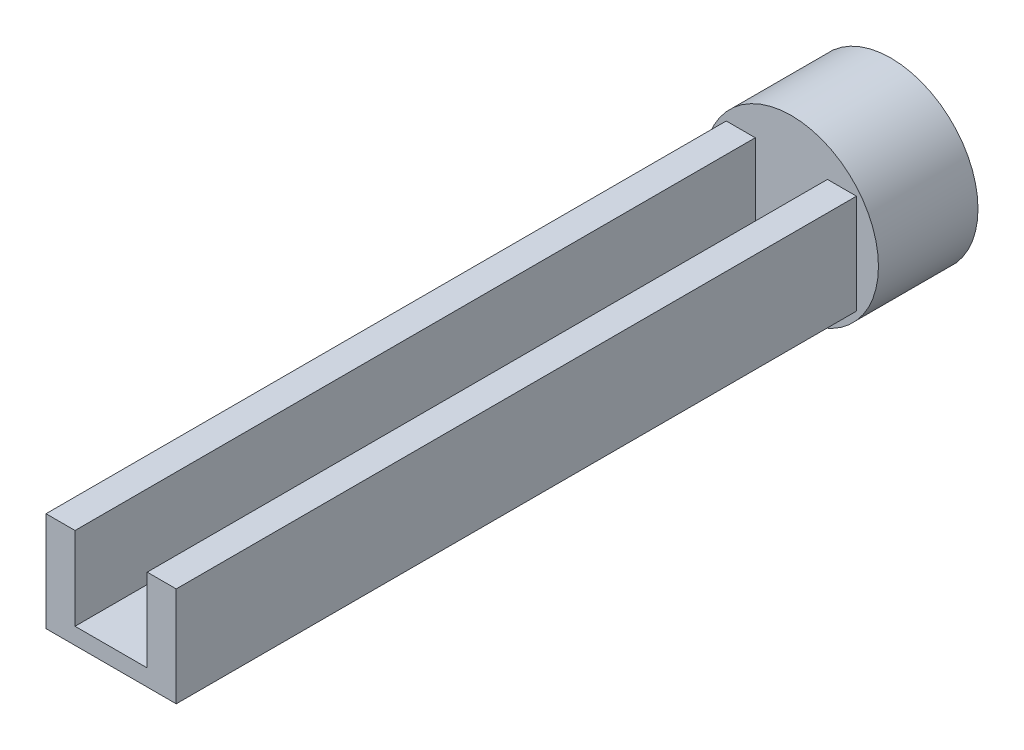
ISO-10303-21;
HEADER;
FILE_DESCRIPTION(('STEP AP214'),'2;1');
FILE_NAME('part.step','',(''),(''),'','','');
FILE_SCHEMA(('AUTOMOTIVE_DESIGN { 1 0 10303 214 1 1 1 1 }'));
ENDSEC;
DATA;
#1=APPLICATION_CONTEXT('core data for automotive mechanical design processes');
#2=APPLICATION_PROTOCOL_DEFINITION('international standard','automotive_design',2000,#1);
#3=PRODUCT_CONTEXT('',#1,'mechanical');
#4=PRODUCT('Part','Part','',(#3));
#5=PRODUCT_RELATED_PRODUCT_CATEGORY('part','',(#4));
#6=PRODUCT_DEFINITION_FORMATION('','',#4);
#7=PRODUCT_DEFINITION_CONTEXT('part definition',#1,'design');
#8=PRODUCT_DEFINITION('design','',#6,#7);
#9=PRODUCT_DEFINITION_SHAPE('','',#8);
#10=(LENGTH_UNIT() NAMED_UNIT(*) SI_UNIT(.MILLI.,.METRE.));
#11=(NAMED_UNIT(*) PLANE_ANGLE_UNIT() SI_UNIT($,.RADIAN.));
#12=(NAMED_UNIT(*) SI_UNIT($,.STERADIAN.) SOLID_ANGLE_UNIT());
#13=UNCERTAINTY_MEASURE_WITH_UNIT(LENGTH_MEASURE(1.E-05),#10,'distance_accuracy_value','');
#14=(GEOMETRIC_REPRESENTATION_CONTEXT(3) GLOBAL_UNCERTAINTY_ASSIGNED_CONTEXT((#13)) GLOBAL_UNIT_ASSIGNED_CONTEXT((#10,
#11,#12)) REPRESENTATION_CONTEXT('',''));
#15=CARTESIAN_POINT('',(0.,0.,0.));
#16=DIRECTION('',(0.,0.,1.));
#17=DIRECTION('',(1.,0.,0.));
#18=AXIS2_PLACEMENT_3D('',#15,#16,#17);
#19=CARTESIAN_POINT('',(0.,12.,0.));
#20=DIRECTION('',(0.,1.,0.));
#21=DIRECTION('',(0.,0.,1.));
#22=AXIS2_PLACEMENT_3D('',#19,#20,#21);
#23=PLANE('',#22);
#24=DIRECTION('',(0.,0.,-1.));
#25=VECTOR('',#24,1.);
#26=CARTESIAN_POINT('',(4.35,12.,41.));
#27=LINE('',#26,#25);
#28=CARTESIAN_POINT('',(4.35,12.,41.));
#29=VERTEX_POINT('',#28);
#30=CARTESIAN_POINT('',(4.35,12.,-41.));
#31=VERTEX_POINT('',#30);
#32=EDGE_CURVE('E135',#29,#31,#27,.T.);
#33=ORIENTED_EDGE('',*,*,#32,.F.);
#34=DIRECTION('',(1.,0.,0.));
#35=VECTOR('',#34,1.);
#36=CARTESIAN_POINT('',(7.85,12.,41.));
#37=LINE('',#36,#35);
#38=CARTESIAN_POINT('',(7.85,12.,41.));
#39=VERTEX_POINT('',#38);
#40=EDGE_CURVE('E58',#29,#39,#37,.T.);
#41=ORIENTED_EDGE('',*,*,#40,.T.);
#42=DIRECTION('',(0.,0.,-1.));
#43=VECTOR('',#42,1.);
#44=CARTESIAN_POINT('',(7.85,12.,41.));
#45=LINE('',#44,#43);
#46=CARTESIAN_POINT('',(7.85,12.,-41.));
#47=VERTEX_POINT('',#46);
#48=EDGE_CURVE('E88',#39,#47,#45,.T.);
#49=ORIENTED_EDGE('',*,*,#48,.T.);
#50=DIRECTION('',(-1.,0.,0.));
#51=VECTOR('',#50,1.);
#52=CARTESIAN_POINT('',(7.85,12.,-41.));
#53=LINE('',#52,#51);
#54=EDGE_CURVE('E101',#47,#31,#53,.T.);
#55=ORIENTED_EDGE('',*,*,#54,.T.);
#56=EDGE_LOOP('',(#33,#41,#49,#55));
#57=FACE_BOUND('',#56,.T.);
#58=ADVANCED_FACE('F34',(#57),#23,.T.);
#59=CARTESIAN_POINT('',(-7.85,12.,41.));
#60=DIRECTION('',(1.,0.,0.));
#61=DIRECTION('',(0.,0.,-1.));
#62=AXIS2_PLACEMENT_3D('',#59,#60,#61);
#63=PLANE('',#62);
#64=DIRECTION('',(0.,0.,1.));
#65=VECTOR('',#64,1.);
#66=CARTESIAN_POINT('',(-7.85,0.,41.));
#67=LINE('',#66,#65);
#68=CARTESIAN_POINT('',(-7.85,0.,-41.));
#69=VERTEX_POINT('',#68);
#70=CARTESIAN_POINT('',(-7.85,0.,41.));
#71=VERTEX_POINT('',#70);
#72=EDGE_CURVE('E80',#69,#71,#67,.T.);
#73=ORIENTED_EDGE('',*,*,#72,.T.);
#74=DIRECTION('',(0.,-1.,0.));
#75=VECTOR('',#74,1.);
#76=CARTESIAN_POINT('',(-7.85,12.,41.));
#77=LINE('',#76,#75);
#78=CARTESIAN_POINT('',(-7.85,12.,41.));
#79=VERTEX_POINT('',#78);
#80=EDGE_CURVE('E11',#79,#71,#77,.T.);
#81=ORIENTED_EDGE('',*,*,#80,.F.);
#82=DIRECTION('',(0.,0.,1.));
#83=VECTOR('',#82,1.);
#84=CARTESIAN_POINT('',(-7.85,12.,41.));
#85=LINE('',#84,#83);
#86=CARTESIAN_POINT('',(-7.85,12.,-41.));
#87=VERTEX_POINT('',#86);
#88=EDGE_CURVE('E94',#87,#79,#85,.T.);
#89=ORIENTED_EDGE('',*,*,#88,.F.);
#90=DIRECTION('',(0.,-1.,0.));
#91=VECTOR('',#90,1.);
#92=CARTESIAN_POINT('',(-7.85,12.,-41.));
#93=LINE('',#92,#91);
#94=EDGE_CURVE('E98',#87,#69,#93,.T.);
#95=ORIENTED_EDGE('',*,*,#94,.T.);
#96=EDGE_LOOP('',(#73,#81,#89,#95));
#97=FACE_BOUND('',#96,.T.);
#98=ADVANCED_FACE('F36',(#97),#63,.F.);
#99=CARTESIAN_POINT('',(7.85,12.,41.));
#100=DIRECTION('',(0.,0.,-1.));
#101=DIRECTION('',(-1.,0.,0.));
#102=AXIS2_PLACEMENT_3D('',#99,#100,#101);
#103=PLANE('',#102);
#104=ORIENTED_EDGE('',*,*,#40,.F.);
#105=DIRECTION('',(0.,1.,0.));
#106=VECTOR('',#105,1.);
#107=CARTESIAN_POINT('',(4.35,2.,41.));
#108=LINE('',#107,#106);
#109=CARTESIAN_POINT('',(4.35,2.,41.));
#110=VERTEX_POINT('',#109);
#111=EDGE_CURVE('E132',#110,#29,#108,.T.);
#112=ORIENTED_EDGE('',*,*,#111,.F.);
#113=DIRECTION('',(1.,0.,0.));
#114=VECTOR('',#113,1.);
#115=CARTESIAN_POINT('',(-4.34999999999999,2.,41.));
#116=LINE('',#115,#114);
#117=CARTESIAN_POINT('',(-4.34999999999999,2.,41.));
#118=VERTEX_POINT('',#117);
#119=EDGE_CURVE('E162',#118,#110,#116,.T.);
#120=ORIENTED_EDGE('',*,*,#119,.F.);
#121=DIRECTION('',(0.,1.,0.));
#122=VECTOR('',#121,1.);
#123=CARTESIAN_POINT('',(-4.34999999999999,2.,41.));
#124=LINE('',#123,#122);
#125=CARTESIAN_POINT('',(-4.34999999999999,12.,41.));
#126=VERTEX_POINT('',#125);
#127=EDGE_CURVE('E140',#118,#126,#124,.T.);
#128=ORIENTED_EDGE('',*,*,#127,.T.);
#129=EDGE_CURVE('E145',#79,#126,#37,.T.);
#130=ORIENTED_EDGE('',*,*,#129,.F.);
#131=ORIENTED_EDGE('',*,*,#80,.T.);
#132=DIRECTION('',(1.,0.,0.));
#133=VECTOR('',#132,1.);
#134=CARTESIAN_POINT('',(7.85,0.,41.));
#135=LINE('',#134,#133);
#136=CARTESIAN_POINT('',(7.85,0.,41.));
#137=VERTEX_POINT('',#136);
#138=EDGE_CURVE('E70',#71,#137,#135,.T.);
#139=ORIENTED_EDGE('',*,*,#138,.T.);
#140=DIRECTION('',(0.,-1.,0.));
#141=VECTOR('',#140,1.);
#142=CARTESIAN_POINT('',(7.85,12.,41.));
#143=LINE('',#142,#141);
#144=EDGE_CURVE('E42',#39,#137,#143,.T.);
#145=ORIENTED_EDGE('',*,*,#144,.F.);
#146=EDGE_LOOP('',(#104,#112,#120,#128,#130,#131,#139,#145));
#147=FACE_BOUND('',#146,.T.);
#148=ADVANCED_FACE('F72',(#147),#103,.F.);
#149=CARTESIAN_POINT('',(7.85,12.,41.));
#150=DIRECTION('',(-1.,0.,0.));
#151=DIRECTION('',(0.,0.,1.));
#152=AXIS2_PLACEMENT_3D('',#149,#150,#151);
#153=PLANE('',#152);
#154=DIRECTION('',(0.,0.,-1.));
#155=VECTOR('',#154,1.);
#156=CARTESIAN_POINT('',(7.85,0.,41.));
#157=LINE('',#156,#155);
#158=CARTESIAN_POINT('',(7.85,0.,-41.));
#159=VERTEX_POINT('',#158);
#160=EDGE_CURVE('E79',#137,#159,#157,.T.);
#161=ORIENTED_EDGE('',*,*,#160,.T.);
#162=DIRECTION('',(0.,-1.,0.));
#163=VECTOR('',#162,1.);
#164=CARTESIAN_POINT('',(7.85,12.,-41.));
#165=LINE('',#164,#163);
#166=EDGE_CURVE('E89',#47,#159,#165,.T.);
#167=ORIENTED_EDGE('',*,*,#166,.F.);
#168=ORIENTED_EDGE('',*,*,#48,.F.);
#169=ORIENTED_EDGE('',*,*,#144,.T.);
#170=EDGE_LOOP('',(#161,#167,#168,#169));
#171=FACE_BOUND('',#170,.T.);
#172=ADVANCED_FACE('F84',(#171),#153,.F.);
#173=DIRECTION('',(0.,0.,1.));
#174=VECTOR('',#173,1.);
#175=CARTESIAN_POINT('',(-4.35,12.,-41.));
#176=LINE('',#175,#174);
#177=CARTESIAN_POINT('',(-4.35,12.,-41.));
#178=VERTEX_POINT('',#177);
#179=EDGE_CURVE('E143',#178,#126,#176,.T.);
#180=ORIENTED_EDGE('',*,*,#179,.F.);
#181=EDGE_CURVE('E49',#178,#87,#53,.T.);
#182=ORIENTED_EDGE('',*,*,#181,.T.);
#183=ORIENTED_EDGE('',*,*,#88,.T.);
#184=ORIENTED_EDGE('',*,*,#129,.T.);
#185=EDGE_LOOP('',(#180,#182,#183,#184));
#186=FACE_BOUND('',#185,.T.);
#187=ADVANCED_FACE('F182',(#186),#23,.T.);
#188=CARTESIAN_POINT('',(0.,0.,0.));
#189=DIRECTION('',(0.,1.,0.));
#190=DIRECTION('',(0.,0.,1.));
#191=AXIS2_PLACEMENT_3D('',#188,#189,#190);
#192=PLANE('',#191);
#193=ORIENTED_EDGE('',*,*,#72,.F.);
#194=DIRECTION('',(-1.,0.,0.));
#195=VECTOR('',#194,1.);
#196=CARTESIAN_POINT('',(7.85,0.,-41.));
#197=LINE('',#196,#195);
#198=EDGE_CURVE('E92',#159,#69,#197,.T.);
#199=ORIENTED_EDGE('',*,*,#198,.F.);
#200=ORIENTED_EDGE('',*,*,#160,.F.);
#201=ORIENTED_EDGE('',*,*,#138,.F.);
#202=EDGE_LOOP('',(#193,#199,#200,#201));
#203=FACE_BOUND('',#202,.T.);
#204=ADVANCED_FACE('F90',(#203),#192,.F.);
#205=CARTESIAN_POINT('',(4.35,2.,41.));
#206=DIRECTION('',(1.,0.,0.));
#207=DIRECTION('',(0.,0.,-1.));
#208=AXIS2_PLACEMENT_3D('',#205,#206,#207);
#209=PLANE('',#208);
#210=ORIENTED_EDGE('',*,*,#32,.T.);
#211=DIRECTION('',(0.,1.,0.));
#212=VECTOR('',#211,1.);
#213=CARTESIAN_POINT('',(4.35,2.,-41.));
#214=LINE('',#213,#212);
#215=CARTESIAN_POINT('',(4.35,2.,-41.));
#216=VERTEX_POINT('',#215);
#217=EDGE_CURVE('E139',#216,#31,#214,.T.);
#218=ORIENTED_EDGE('',*,*,#217,.F.);
#219=DIRECTION('',(0.,0.,-1.));
#220=VECTOR('',#219,1.);
#221=CARTESIAN_POINT('',(4.35,2.,41.));
#222=LINE('',#221,#220);
#223=EDGE_CURVE('E137',#110,#216,#222,.T.);
#224=ORIENTED_EDGE('',*,*,#223,.F.);
#225=ORIENTED_EDGE('',*,*,#111,.T.);
#226=EDGE_LOOP('',(#210,#218,#224,#225));
#227=FACE_BOUND('',#226,.T.);
#228=ADVANCED_FACE('F133',(#227),#209,.F.);
#229=CARTESIAN_POINT('',(-4.35,2.,-41.));
#230=DIRECTION('',(-1.,0.,0.));
#231=DIRECTION('',(0.,0.,1.));
#232=AXIS2_PLACEMENT_3D('',#229,#230,#231);
#233=PLANE('',#232);
#234=ORIENTED_EDGE('',*,*,#179,.T.);
#235=ORIENTED_EDGE('',*,*,#127,.F.);
#236=DIRECTION('',(0.,0.,1.));
#237=VECTOR('',#236,1.);
#238=CARTESIAN_POINT('',(-4.35,2.,-41.));
#239=LINE('',#238,#237);
#240=CARTESIAN_POINT('',(-4.35,2.,-41.));
#241=VERTEX_POINT('',#240);
#242=EDGE_CURVE('E166',#241,#118,#239,.T.);
#243=ORIENTED_EDGE('',*,*,#242,.F.);
#244=DIRECTION('',(0.,1.,0.));
#245=VECTOR('',#244,1.);
#246=CARTESIAN_POINT('',(-4.35,2.,-41.));
#247=LINE('',#246,#245);
#248=EDGE_CURVE('E158',#241,#178,#247,.T.);
#249=ORIENTED_EDGE('',*,*,#248,.T.);
#250=EDGE_LOOP('',(#234,#235,#243,#249));
#251=FACE_BOUND('',#250,.T.);
#252=ADVANCED_FACE('F230',(#251),#233,.F.);
#253=CARTESIAN_POINT('',(0.,2.,0.));
#254=DIRECTION('',(0.,1.,0.));
#255=DIRECTION('',(0.,0.,1.));
#256=AXIS2_PLACEMENT_3D('',#253,#254,#255);
#257=PLANE('',#256);
#258=DIRECTION('',(-1.,0.,0.));
#259=VECTOR('',#258,1.);
#260=CARTESIAN_POINT('',(4.35,2.,-41.));
#261=LINE('',#260,#259);
#262=EDGE_CURVE('E142',#216,#241,#261,.T.);
#263=ORIENTED_EDGE('',*,*,#262,.T.);
#264=ORIENTED_EDGE('',*,*,#242,.T.);
#265=ORIENTED_EDGE('',*,*,#119,.T.);
#266=ORIENTED_EDGE('',*,*,#223,.T.);
#267=EDGE_LOOP('',(#263,#264,#265,#266));
#268=FACE_BOUND('',#267,.T.);
#269=ADVANCED_FACE('F179',(#268),#257,.T.);
#270=CARTESIAN_POINT('',(0.,5.99999999999999,-53.));
#271=DIRECTION('',(0.,0.,1.));
#272=DIRECTION('',(1.,0.,0.));
#273=AXIS2_PLACEMENT_3D('',#270,#271,#272);
#274=CYLINDRICAL_SURFACE('',#273,10.5);
#275=CARTESIAN_POINT('',(0.,5.99999999999999,-53.));
#276=DIRECTION('',(0.,0.,-1.));
#277=DIRECTION('',(-1.,0.,0.));
#278=AXIS2_PLACEMENT_3D('',#275,#276,#277);
#279=CIRCLE('',#278,10.5);
#280=CARTESIAN_POINT('',(-10.5,5.99999999999999,-53.));
#281=VERTEX_POINT('',#280);
#282=EDGE_CURVE('E169',#281,#281,#279,.T.);
#283=ORIENTED_EDGE('',*,*,#282,.F.);
#284=EDGE_LOOP('',(#283));
#285=FACE_BOUND('',#284,.T.);
#286=CARTESIAN_POINT('',(0.,5.99999999999999,-41.));
#287=DIRECTION('',(0.,0.,-1.));
#288=DIRECTION('',(-1.,0.,0.));
#289=AXIS2_PLACEMENT_3D('',#286,#287,#288);
#290=CIRCLE('',#289,10.5);
#291=CARTESIAN_POINT('',(-10.5,5.99999999999999,-41.));
#292=VERTEX_POINT('',#291);
#293=EDGE_CURVE('E171',#292,#292,#290,.T.);
#294=ORIENTED_EDGE('',*,*,#293,.T.);
#295=EDGE_LOOP('',(#294));
#296=FACE_BOUND('',#295,.T.);
#297=ADVANCED_FACE('F244',(#285,#296),#274,.T.);
#298=CARTESIAN_POINT('',(0.,5.99999999999999,-53.));
#299=DIRECTION('',(0.,0.,-1.));
#300=DIRECTION('',(-1.,0.,0.));
#301=AXIS2_PLACEMENT_3D('',#298,#299,#300);
#302=PLANE('',#301);
#303=ORIENTED_EDGE('',*,*,#282,.T.);
#304=EDGE_LOOP('',(#303));
#305=FACE_BOUND('',#304,.T.);
#306=ADVANCED_FACE('F252',(#305),#302,.T.);
#307=CARTESIAN_POINT('',(0.,5.99999999999999,-41.));
#308=DIRECTION('',(0.,0.,-1.));
#309=DIRECTION('',(-1.,0.,0.));
#310=AXIS2_PLACEMENT_3D('',#307,#308,#309);
#311=PLANE('',#310);
#312=ORIENTED_EDGE('',*,*,#262,.F.);
#313=ORIENTED_EDGE('',*,*,#217,.T.);
#314=ORIENTED_EDGE('',*,*,#54,.F.);
#315=ORIENTED_EDGE('',*,*,#166,.T.);
#316=ORIENTED_EDGE('',*,*,#198,.T.);
#317=ORIENTED_EDGE('',*,*,#94,.F.);
#318=ORIENTED_EDGE('',*,*,#181,.F.);
#319=ORIENTED_EDGE('',*,*,#248,.F.);
#320=EDGE_LOOP('',(#312,#313,#314,#315,#316,#317,#318,#319));
#321=FACE_BOUND('',#320,.T.);
#322=ORIENTED_EDGE('',*,*,#293,.F.);
#323=EDGE_LOOP('',(#322));
#324=FACE_BOUND('',#323,.T.);
#325=ADVANCED_FACE('F105',(#321,#324),#311,.F.);
#326=CLOSED_SHELL('',(#58,#98,#148,#172,#187,#204,#228,#252,#269,#297,#306,#325));
#327=MANIFOLD_SOLID_BREP('B2',#326);
#328=ADVANCED_BREP_SHAPE_REPRESENTATION('',(#18,#327),#14);
#329=SHAPE_DEFINITION_REPRESENTATION(#9,#328);
ENDSEC;
END-ISO-10303-21;
